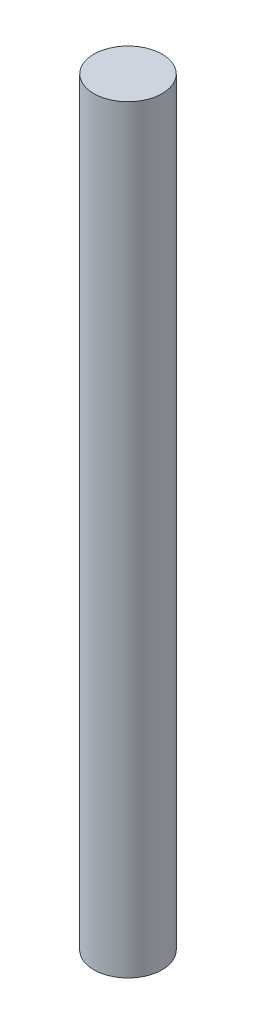
ISO-10303-21;
HEADER;
FILE_DESCRIPTION(('STEP AP214'),'2;1');
FILE_NAME('part.step','',(''),(''),'','','');
FILE_SCHEMA(('AUTOMOTIVE_DESIGN { 1 0 10303 214 1 1 1 1 }'));
ENDSEC;
DATA;
#1=APPLICATION_CONTEXT('core data for automotive mechanical design processes');
#2=APPLICATION_PROTOCOL_DEFINITION('international standard','automotive_design',2000,#1);
#3=PRODUCT_CONTEXT('',#1,'mechanical');
#4=PRODUCT('Part','Part','',(#3));
#5=PRODUCT_RELATED_PRODUCT_CATEGORY('part','',(#4));
#6=PRODUCT_DEFINITION_FORMATION('','',#4);
#7=PRODUCT_DEFINITION_CONTEXT('part definition',#1,'design');
#8=PRODUCT_DEFINITION('design','',#6,#7);
#9=PRODUCT_DEFINITION_SHAPE('','',#8);
#10=(LENGTH_UNIT() NAMED_UNIT(*) SI_UNIT(.MILLI.,.METRE.));
#11=(NAMED_UNIT(*) PLANE_ANGLE_UNIT() SI_UNIT($,.RADIAN.));
#12=(NAMED_UNIT(*) SI_UNIT($,.STERADIAN.) SOLID_ANGLE_UNIT());
#13=UNCERTAINTY_MEASURE_WITH_UNIT(LENGTH_MEASURE(1.E-05),#10,'distance_accuracy_value','');
#14=(GEOMETRIC_REPRESENTATION_CONTEXT(3) GLOBAL_UNCERTAINTY_ASSIGNED_CONTEXT((#13)) GLOBAL_UNIT_ASSIGNED_CONTEXT((#10,
#11,#12)) REPRESENTATION_CONTEXT('',''));
#15=CARTESIAN_POINT('',(0.,0.,0.));
#16=DIRECTION('',(0.,0.,1.));
#17=DIRECTION('',(1.,0.,0.));
#18=AXIS2_PLACEMENT_3D('',#15,#16,#17);
#19=CARTESIAN_POINT('',(0.,100.,0.));
#20=DIRECTION('',(0.,-1.,0.));
#21=DIRECTION('',(0.,0.,-1.));
#22=AXIS2_PLACEMENT_3D('',#19,#20,#21);
#23=CYLINDRICAL_SURFACE('',#22,4.5);
#24=CARTESIAN_POINT('',(0.,100.,0.));
#25=DIRECTION('',(0.,1.,0.));
#26=DIRECTION('',(0.,0.,1.));
#27=AXIS2_PLACEMENT_3D('',#24,#25,#26);
#28=CIRCLE('',#27,4.5);
#29=CARTESIAN_POINT('',(0.,100.,4.5));
#30=VERTEX_POINT('',#29);
#31=EDGE_CURVE('E10',#30,#30,#28,.T.);
#32=ORIENTED_EDGE('',*,*,#31,.F.);
#33=EDGE_LOOP('',(#32));
#34=FACE_BOUND('',#33,.T.);
#35=CARTESIAN_POINT('',(0.,0.,0.));
#36=DIRECTION('',(0.,1.,0.));
#37=DIRECTION('',(0.,0.,1.));
#38=AXIS2_PLACEMENT_3D('',#35,#36,#37);
#39=CIRCLE('',#38,4.5);
#40=CARTESIAN_POINT('',(0.,0.,4.5));
#41=VERTEX_POINT('',#40);
#42=EDGE_CURVE('E44',#41,#41,#39,.T.);
#43=ORIENTED_EDGE('',*,*,#42,.T.);
#44=EDGE_LOOP('',(#43));
#45=FACE_BOUND('',#44,.T.);
#46=ADVANCED_FACE('F41',(#34,#45),#23,.T.);
#47=CARTESIAN_POINT('',(0.,100.,0.));
#48=DIRECTION('',(0.,1.,0.));
#49=DIRECTION('',(0.,0.,1.));
#50=AXIS2_PLACEMENT_3D('',#47,#48,#49);
#51=PLANE('',#50);
#52=ORIENTED_EDGE('',*,*,#31,.T.);
#53=EDGE_LOOP('',(#52));
#54=FACE_BOUND('',#53,.T.);
#55=ADVANCED_FACE('F58',(#54),#51,.T.);
#56=CARTESIAN_POINT('',(0.,0.,0.));
#57=DIRECTION('',(0.,1.,0.));
#58=DIRECTION('',(0.,0.,1.));
#59=AXIS2_PLACEMENT_3D('',#56,#57,#58);
#60=PLANE('',#59);
#61=ORIENTED_EDGE('',*,*,#42,.F.);
#62=EDGE_LOOP('',(#61));
#63=FACE_BOUND('',#62,.T.);
#64=ADVANCED_FACE('F56',(#63),#60,.F.);
#65=CLOSED_SHELL('',(#46,#55,#64));
#66=MANIFOLD_SOLID_BREP('B2',#65);
#67=ADVANCED_BREP_SHAPE_REPRESENTATION('',(#18,#66),#14);
#68=SHAPE_DEFINITION_REPRESENTATION(#9,#67);
ENDSEC;
END-ISO-10303-21;
